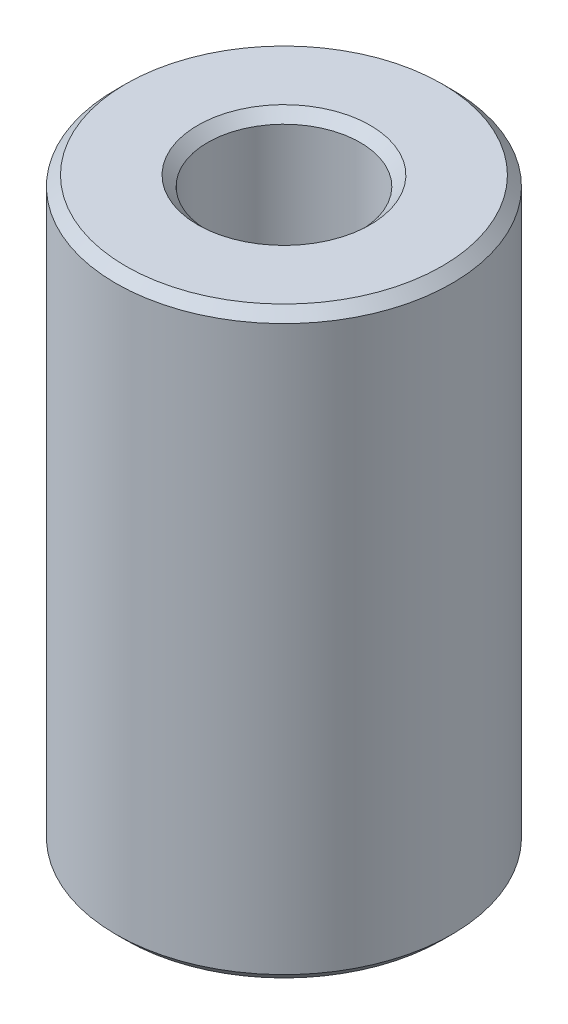
ISO-10303-21;
HEADER;
FILE_DESCRIPTION(('STEP AP214'),'2;1');
FILE_NAME('part.step','',(''),(''),'','','');
FILE_SCHEMA(('AUTOMOTIVE_DESIGN { 1 0 10303 214 1 1 1 1 }'));
ENDSEC;
DATA;
#1=APPLICATION_CONTEXT('core data for automotive mechanical design processes');
#2=APPLICATION_PROTOCOL_DEFINITION('international standard','automotive_design',2000,#1);
#3=PRODUCT_CONTEXT('',#1,'mechanical');
#4=PRODUCT('Part','Part','',(#3));
#5=PRODUCT_RELATED_PRODUCT_CATEGORY('part','',(#4));
#6=PRODUCT_DEFINITION_FORMATION('','',#4);
#7=PRODUCT_DEFINITION_CONTEXT('part definition',#1,'design');
#8=PRODUCT_DEFINITION('design','',#6,#7);
#9=PRODUCT_DEFINITION_SHAPE('','',#8);
#10=(LENGTH_UNIT() NAMED_UNIT(*) SI_UNIT(.MILLI.,.METRE.));
#11=(NAMED_UNIT(*) PLANE_ANGLE_UNIT() SI_UNIT($,.RADIAN.));
#12=(NAMED_UNIT(*) SI_UNIT($,.STERADIAN.) SOLID_ANGLE_UNIT());
#13=UNCERTAINTY_MEASURE_WITH_UNIT(LENGTH_MEASURE(1.E-05),#10,'distance_accuracy_value','');
#14=(GEOMETRIC_REPRESENTATION_CONTEXT(3) GLOBAL_UNCERTAINTY_ASSIGNED_CONTEXT((#13)) GLOBAL_UNIT_ASSIGNED_CONTEXT((#10,
#11,#12)) REPRESENTATION_CONTEXT('',''));
#15=CARTESIAN_POINT('',(0.,0.,0.));
#16=DIRECTION('',(0.,0.,1.));
#17=DIRECTION('',(1.,0.,0.));
#18=AXIS2_PLACEMENT_3D('',#15,#16,#17);
#19=CARTESIAN_POINT('',(0.,17.3743762688091,0.));
#20=DIRECTION('',(0.,-1.,0.));
#21=DIRECTION('',(0.,0.,-1.));
#22=AXIS2_PLACEMENT_3D('',#19,#20,#21);
#23=CYLINDRICAL_SURFACE('',#22,5.);
#24=CARTESIAN_POINT('',(0.,0.295600076507266,0.));
#25=DIRECTION('',(0.,1.,0.));
#26=DIRECTION('',(0.,0.,1.));
#27=AXIS2_PLACEMENT_3D('',#24,#25,#26);
#28=CIRCLE('',#27,5.);
#29=CARTESIAN_POINT('',(0.,0.295600076507266,5.));
#30=VERTEX_POINT('',#29);
#31=EDGE_CURVE('E10',#30,#30,#28,.T.);
#32=ORIENTED_EDGE('',*,*,#31,.T.);
#33=EDGE_LOOP('',(#32));
#34=FACE_BOUND('',#33,.T.);
#35=CARTESIAN_POINT('',(0.,17.0787761923018,0.));
#36=DIRECTION('',(0.,1.,0.));
#37=DIRECTION('',(0.,0.,1.));
#38=AXIS2_PLACEMENT_3D('',#35,#36,#37);
#39=CIRCLE('',#38,5.);
#40=CARTESIAN_POINT('',(0.,17.0787761923018,5.));
#41=VERTEX_POINT('',#40);
#42=EDGE_CURVE('E50',#41,#41,#39,.F.);
#43=ORIENTED_EDGE('',*,*,#42,.T.);
#44=EDGE_LOOP('',(#43));
#45=FACE_BOUND('',#44,.T.);
#46=ADVANCED_FACE('F39',(#34,#45),#23,.T.);
#47=CARTESIAN_POINT('',(0.,17.3743762688091,0.));
#48=DIRECTION('',(0.,1.,0.));
#49=DIRECTION('',(0.,0.,1.));
#50=AXIS2_PLACEMENT_3D('',#47,#48,#49);
#51=PLANE('',#50);
#52=CARTESIAN_POINT('',(0.,17.3743762688091,0.));
#53=DIRECTION('',(0.,1.,0.));
#54=DIRECTION('',(0.,0.,1.));
#55=AXIS2_PLACEMENT_3D('',#52,#53,#54);
#56=CIRCLE('',#55,2.56712164914604);
#57=CARTESIAN_POINT('',(0.,17.3743762688091,2.56712164914604));
#58=VERTEX_POINT('',#57);
#59=EDGE_CURVE('E58',#58,#58,#56,.F.);
#60=ORIENTED_EDGE('',*,*,#59,.T.);
#61=EDGE_LOOP('',(#60));
#62=FACE_BOUND('',#61,.T.);
#63=CARTESIAN_POINT('',(0.,17.3743762688091,0.));
#64=DIRECTION('',(0.,1.,0.));
#65=DIRECTION('',(0.,0.,1.));
#66=AXIS2_PLACEMENT_3D('',#63,#64,#65);
#67=CIRCLE('',#66,4.70439992349273);
#68=CARTESIAN_POINT('',(0.,17.3743762688091,4.70439992349273));
#69=VERTEX_POINT('',#68);
#70=EDGE_CURVE('E61',#69,#69,#67,.T.);
#71=ORIENTED_EDGE('',*,*,#70,.T.);
#72=EDGE_LOOP('',(#71));
#73=FACE_BOUND('',#72,.T.);
#74=ADVANCED_FACE('F88',(#62,#73),#51,.T.);
#75=CARTESIAN_POINT('',(0.,0.,0.));
#76=DIRECTION('',(0.,1.,0.));
#77=DIRECTION('',(0.,0.,1.));
#78=AXIS2_PLACEMENT_3D('',#75,#76,#77);
#79=PLANE('',#78);
#80=CARTESIAN_POINT('',(0.,0.,0.));
#81=DIRECTION('',(0.,1.,0.));
#82=DIRECTION('',(0.,0.,1.));
#83=AXIS2_PLACEMENT_3D('',#80,#81,#82);
#84=CIRCLE('',#83,2.56712164914604);
#85=CARTESIAN_POINT('',(0.,0.,2.56712164914604));
#86=VERTEX_POINT('',#85);
#87=EDGE_CURVE('E51',#86,#86,#84,.T.);
#88=ORIENTED_EDGE('',*,*,#87,.T.);
#89=EDGE_LOOP('',(#88));
#90=FACE_BOUND('',#89,.T.);
#91=CARTESIAN_POINT('',(0.,0.,0.));
#92=DIRECTION('',(0.,1.,0.));
#93=DIRECTION('',(0.,0.,1.));
#94=AXIS2_PLACEMENT_3D('',#91,#92,#93);
#95=CIRCLE('',#94,4.70439992349274);
#96=CARTESIAN_POINT('',(0.,0.,4.70439992349274));
#97=VERTEX_POINT('',#96);
#98=EDGE_CURVE('E54',#97,#97,#95,.F.);
#99=ORIENTED_EDGE('',*,*,#98,.T.);
#100=EDGE_LOOP('',(#99));
#101=FACE_BOUND('',#100,.T.);
#102=ADVANCED_FACE('F83',(#90,#101),#79,.F.);
#103=CARTESIAN_POINT('',(0.,17.3743762688091,0.));
#104=DIRECTION('',(0.,-1.,0.));
#105=DIRECTION('',(0.,0.,-1.));
#106=AXIS2_PLACEMENT_3D('',#103,#104,#105);
#107=CYLINDRICAL_SURFACE('',#106,2.27152157263877);
#108=CARTESIAN_POINT('',(0.,17.0787761923019,0.));
#109=DIRECTION('',(0.,1.,0.));
#110=DIRECTION('',(0.,0.,1.));
#111=AXIS2_PLACEMENT_3D('',#108,#109,#110);
#112=CIRCLE('',#111,2.27152157263877);
#113=CARTESIAN_POINT('',(0.,17.0787761923019,2.27152157263877));
#114=VERTEX_POINT('',#113);
#115=EDGE_CURVE('E67',#114,#114,#112,.T.);
#116=ORIENTED_EDGE('',*,*,#115,.T.);
#117=EDGE_LOOP('',(#116));
#118=FACE_BOUND('',#117,.T.);
#119=CARTESIAN_POINT('',(0.,0.295600076507269,0.));
#120=DIRECTION('',(0.,1.,0.));
#121=DIRECTION('',(0.,0.,1.));
#122=AXIS2_PLACEMENT_3D('',#119,#120,#121);
#123=CIRCLE('',#122,2.27152157263877);
#124=CARTESIAN_POINT('',(0.,0.295600076507269,2.27152157263877));
#125=VERTEX_POINT('',#124);
#126=EDGE_CURVE('E69',#125,#125,#123,.F.);
#127=ORIENTED_EDGE('',*,*,#126,.T.);
#128=EDGE_LOOP('',(#127));
#129=FACE_BOUND('',#128,.T.);
#130=ADVANCED_FACE('F71',(#118,#129),#107,.F.);
#131=CARTESIAN_POINT('',(0.,17.0787761923019,0.));
#132=DIRECTION('',(0.,1.,0.));
#133=DIRECTION('',(0.,0.,1.));
#134=AXIS2_PLACEMENT_3D('',#131,#132,#133);
#135=CONICAL_SURFACE('',#134,2.27152157263877,0.785398163397451);
#136=ORIENTED_EDGE('',*,*,#59,.F.);
#137=EDGE_LOOP('',(#136));
#138=FACE_BOUND('',#137,.T.);
#139=ORIENTED_EDGE('',*,*,#115,.F.);
#140=EDGE_LOOP('',(#139));
#141=FACE_BOUND('',#140,.T.);
#142=ADVANCED_FACE('F77',(#138,#141),#135,.F.);
#143=CARTESIAN_POINT('',(0.,0.,0.));
#144=DIRECTION('',(0.,-1.,0.));
#145=DIRECTION('',(0.,0.,-1.));
#146=AXIS2_PLACEMENT_3D('',#143,#144,#145);
#147=CONICAL_SURFACE('',#146,2.56712164914604,0.785398163397442);
#148=ORIENTED_EDGE('',*,*,#126,.F.);
#149=EDGE_LOOP('',(#148));
#150=FACE_BOUND('',#149,.T.);
#151=ORIENTED_EDGE('',*,*,#87,.F.);
#152=EDGE_LOOP('',(#151));
#153=FACE_BOUND('',#152,.T.);
#154=ADVANCED_FACE('F73',(#150,#153),#147,.F.);
#155=CARTESIAN_POINT('',(0.,0.295600076507266,0.));
#156=DIRECTION('',(0.,1.,0.));
#157=DIRECTION('',(0.,0.,1.));
#158=AXIS2_PLACEMENT_3D('',#155,#156,#157);
#159=CONICAL_SURFACE('',#158,5.,0.785398163397447);
#160=ORIENTED_EDGE('',*,*,#98,.F.);
#161=EDGE_LOOP('',(#160));
#162=FACE_BOUND('',#161,.T.);
#163=ORIENTED_EDGE('',*,*,#31,.F.);
#164=EDGE_LOOP('',(#163));
#165=FACE_BOUND('',#164,.T.);
#166=ADVANCED_FACE('F76',(#162,#165),#159,.T.);
#167=CARTESIAN_POINT('',(0.,17.3743762688091,0.));
#168=DIRECTION('',(0.,-1.,0.));
#169=DIRECTION('',(0.,0.,-1.));
#170=AXIS2_PLACEMENT_3D('',#167,#168,#169);
#171=CONICAL_SURFACE('',#170,4.70439992349273,0.785398163397435);
#172=ORIENTED_EDGE('',*,*,#42,.F.);
#173=EDGE_LOOP('',(#172));
#174=FACE_BOUND('',#173,.T.);
#175=ORIENTED_EDGE('',*,*,#70,.F.);
#176=EDGE_LOOP('',(#175));
#177=FACE_BOUND('',#176,.T.);
#178=ADVANCED_FACE('F45',(#174,#177),#171,.T.);
#179=CLOSED_SHELL('',(#46,#74,#102,#130,#142,#154,#166,#178));
#180=MANIFOLD_SOLID_BREP('B2',#179);
#181=ADVANCED_BREP_SHAPE_REPRESENTATION('',(#18,#180),#14);
#182=SHAPE_DEFINITION_REPRESENTATION(#9,#181);
ENDSEC;
END-ISO-10303-21;
